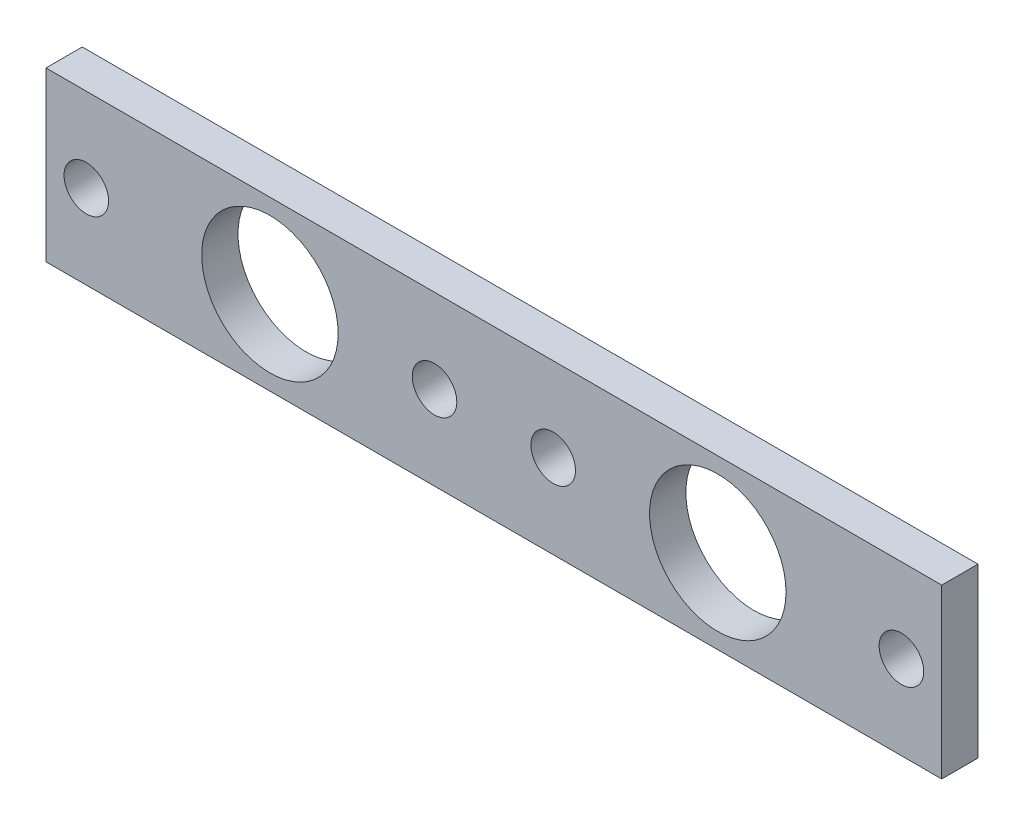
ISO-10303-21;
HEADER;
FILE_DESCRIPTION(('STEP AP214'),'2;1');
FILE_NAME('part.step','',(''),(''),'','','');
FILE_SCHEMA(('AUTOMOTIVE_DESIGN { 1 0 10303 214 1 1 1 1 }'));
ENDSEC;
DATA;
#1=APPLICATION_CONTEXT('core data for automotive mechanical design processes');
#2=APPLICATION_PROTOCOL_DEFINITION('international standard','automotive_design',2000,#1);
#3=PRODUCT_CONTEXT('',#1,'mechanical');
#4=PRODUCT('Part','Part','',(#3));
#5=PRODUCT_RELATED_PRODUCT_CATEGORY('part','',(#4));
#6=PRODUCT_DEFINITION_FORMATION('','',#4);
#7=PRODUCT_DEFINITION_CONTEXT('part definition',#1,'design');
#8=PRODUCT_DEFINITION('design','',#6,#7);
#9=PRODUCT_DEFINITION_SHAPE('','',#8);
#10=(LENGTH_UNIT() NAMED_UNIT(*) SI_UNIT(.MILLI.,.METRE.));
#11=(NAMED_UNIT(*) PLANE_ANGLE_UNIT() SI_UNIT($,.RADIAN.));
#12=(NAMED_UNIT(*) SI_UNIT($,.STERADIAN.) SOLID_ANGLE_UNIT());
#13=UNCERTAINTY_MEASURE_WITH_UNIT(LENGTH_MEASURE(1.E-05),#10,'distance_accuracy_value','');
#14=(GEOMETRIC_REPRESENTATION_CONTEXT(3) GLOBAL_UNCERTAINTY_ASSIGNED_CONTEXT((#13)) GLOBAL_UNIT_ASSIGNED_CONTEXT((#10,
#11,#12)) REPRESENTATION_CONTEXT('',''));
#15=CARTESIAN_POINT('',(0.,0.,0.));
#16=DIRECTION('',(0.,0.,1.));
#17=DIRECTION('',(1.,0.,0.));
#18=AXIS2_PLACEMENT_3D('',#15,#16,#17);
#19=CARTESIAN_POINT('',(-50.8,9.525,4.1148));
#20=DIRECTION('',(1.,0.,0.));
#21=DIRECTION('',(0.,0.,-1.));
#22=AXIS2_PLACEMENT_3D('',#19,#20,#21);
#23=PLANE('',#22);
#24=DIRECTION('',(0.,-1.,0.));
#25=VECTOR('',#24,1.);
#26=CARTESIAN_POINT('',(-50.8,9.525,0.));
#27=LINE('',#26,#25);
#28=CARTESIAN_POINT('',(-50.8,9.525,0.));
#29=VERTEX_POINT('',#28);
#30=CARTESIAN_POINT('',(-50.8,-9.525,0.));
#31=VERTEX_POINT('',#30);
#32=EDGE_CURVE('E108',#29,#31,#27,.T.);
#33=ORIENTED_EDGE('',*,*,#32,.T.);
#34=DIRECTION('',(0.,0.,-1.));
#35=VECTOR('',#34,1.);
#36=CARTESIAN_POINT('',(-50.8,-9.525,4.1148));
#37=LINE('',#36,#35);
#38=CARTESIAN_POINT('',(-50.8,-9.525,4.1148));
#39=VERTEX_POINT('',#38);
#40=EDGE_CURVE('E13',#39,#31,#37,.T.);
#41=ORIENTED_EDGE('',*,*,#40,.F.);
#42=DIRECTION('',(0.,-1.,0.));
#43=VECTOR('',#42,1.);
#44=CARTESIAN_POINT('',(-50.8,9.525,4.1148));
#45=LINE('',#44,#43);
#46=CARTESIAN_POINT('',(-50.8,9.525,4.1148));
#47=VERTEX_POINT('',#46);
#48=EDGE_CURVE('E96',#47,#39,#45,.T.);
#49=ORIENTED_EDGE('',*,*,#48,.F.);
#50=DIRECTION('',(0.,0.,-1.));
#51=VECTOR('',#50,1.);
#52=CARTESIAN_POINT('',(-50.8,9.525,4.1148));
#53=LINE('',#52,#51);
#54=EDGE_CURVE('E104',#47,#29,#53,.T.);
#55=ORIENTED_EDGE('',*,*,#54,.T.);
#56=EDGE_LOOP('',(#33,#41,#49,#55));
#57=FACE_BOUND('',#56,.T.);
#58=ADVANCED_FACE('F45',(#57),#23,.F.);
#59=CARTESIAN_POINT('',(-50.8,-9.525,4.1148));
#60=DIRECTION('',(0.,1.,0.));
#61=DIRECTION('',(-1.,0.,0.));
#62=AXIS2_PLACEMENT_3D('',#59,#60,#61);
#63=PLANE('',#62);
#64=DIRECTION('',(1.,0.,0.));
#65=VECTOR('',#64,1.);
#66=CARTESIAN_POINT('',(-50.8,-9.525,0.));
#67=LINE('',#66,#65);
#68=CARTESIAN_POINT('',(50.8,-9.52499999999998,0.));
#69=VERTEX_POINT('',#68);
#70=EDGE_CURVE('E100',#31,#69,#67,.T.);
#71=ORIENTED_EDGE('',*,*,#70,.T.);
#72=DIRECTION('',(0.,0.,-1.));
#73=VECTOR('',#72,1.);
#74=CARTESIAN_POINT('',(50.8,-9.52499999999998,4.1148));
#75=LINE('',#74,#73);
#76=CARTESIAN_POINT('',(50.8,-9.52499999999998,4.1148));
#77=VERTEX_POINT('',#76);
#78=EDGE_CURVE('E53',#77,#69,#75,.T.);
#79=ORIENTED_EDGE('',*,*,#78,.F.);
#80=DIRECTION('',(1.,0.,0.));
#81=VECTOR('',#80,1.);
#82=CARTESIAN_POINT('',(-50.8,-9.525,4.1148));
#83=LINE('',#82,#81);
#84=EDGE_CURVE('E91',#39,#77,#83,.T.);
#85=ORIENTED_EDGE('',*,*,#84,.F.);
#86=ORIENTED_EDGE('',*,*,#40,.T.);
#87=EDGE_LOOP('',(#71,#79,#85,#86));
#88=FACE_BOUND('',#87,.T.);
#89=ADVANCED_FACE('F99',(#88),#63,.F.);
#90=CARTESIAN_POINT('',(50.8,9.52499999999999,4.1148));
#91=DIRECTION('',(-1.,0.,0.));
#92=DIRECTION('',(0.,0.,1.));
#93=AXIS2_PLACEMENT_3D('',#90,#91,#92);
#94=PLANE('',#93);
#95=DIRECTION('',(0.,1.,0.));
#96=VECTOR('',#95,1.);
#97=CARTESIAN_POINT('',(50.8,9.52499999999999,0.));
#98=LINE('',#97,#96);
#99=CARTESIAN_POINT('',(50.8,9.52499999999999,0.));
#100=VERTEX_POINT('',#99);
#101=EDGE_CURVE('E78',#69,#100,#98,.T.);
#102=ORIENTED_EDGE('',*,*,#101,.T.);
#103=DIRECTION('',(0.,0.,-1.));
#104=VECTOR('',#103,1.);
#105=CARTESIAN_POINT('',(50.8,9.52499999999999,4.1148));
#106=LINE('',#105,#104);
#107=CARTESIAN_POINT('',(50.8,9.52499999999999,4.1148));
#108=VERTEX_POINT('',#107);
#109=EDGE_CURVE('E101',#108,#100,#106,.T.);
#110=ORIENTED_EDGE('',*,*,#109,.F.);
#111=DIRECTION('',(0.,1.,0.));
#112=VECTOR('',#111,1.);
#113=CARTESIAN_POINT('',(50.8,9.52499999999999,4.1148));
#114=LINE('',#113,#112);
#115=EDGE_CURVE('E94',#77,#108,#114,.T.);
#116=ORIENTED_EDGE('',*,*,#115,.F.);
#117=ORIENTED_EDGE('',*,*,#78,.T.);
#118=EDGE_LOOP('',(#102,#110,#116,#117));
#119=FACE_BOUND('',#118,.T.);
#120=ADVANCED_FACE('F102',(#119),#94,.F.);
#121=CARTESIAN_POINT('',(-50.8,9.525,4.1148));
#122=DIRECTION('',(0.,-1.,0.));
#123=DIRECTION('',(1.,0.,0.));
#124=AXIS2_PLACEMENT_3D('',#121,#122,#123);
#125=PLANE('',#124);
#126=DIRECTION('',(-1.,0.,0.));
#127=VECTOR('',#126,1.);
#128=CARTESIAN_POINT('',(-50.8,9.525,0.));
#129=LINE('',#128,#127);
#130=EDGE_CURVE('E84',#100,#29,#129,.T.);
#131=ORIENTED_EDGE('',*,*,#130,.T.);
#132=ORIENTED_EDGE('',*,*,#54,.F.);
#133=DIRECTION('',(-1.,0.,0.));
#134=VECTOR('',#133,1.);
#135=CARTESIAN_POINT('',(-50.8,9.525,4.1148));
#136=LINE('',#135,#134);
#137=EDGE_CURVE('E61',#108,#47,#136,.T.);
#138=ORIENTED_EDGE('',*,*,#137,.F.);
#139=ORIENTED_EDGE('',*,*,#109,.T.);
#140=EDGE_LOOP('',(#131,#132,#138,#139));
#141=FACE_BOUND('',#140,.T.);
#142=ADVANCED_FACE('F116',(#141),#125,.F.);
#143=CARTESIAN_POINT('',(-50.8,-9.525,4.1148));
#144=DIRECTION('',(0.,0.,1.));
#145=DIRECTION('',(1.,0.,0.));
#146=AXIS2_PLACEMENT_3D('',#143,#144,#145);
#147=PLANE('',#146);
#148=CARTESIAN_POINT('',(-25.4,0.,4.1148));
#149=DIRECTION('',(0.,0.,1.));
#150=DIRECTION('',(1.,0.,0.));
#151=AXIS2_PLACEMENT_3D('',#148,#149,#150);
#152=CIRCLE('',#151,7.739126);
#153=CARTESIAN_POINT('',(-17.660874,0.,4.1148));
#154=VERTEX_POINT('',#153);
#155=EDGE_CURVE('E154',#154,#154,#152,.T.);
#156=ORIENTED_EDGE('',*,*,#155,.F.);
#157=EDGE_LOOP('',(#156));
#158=FACE_BOUND('',#157,.T.);
#159=CARTESIAN_POINT('',(25.4,0.,4.1148));
#160=DIRECTION('',(0.,0.,1.));
#161=DIRECTION('',(1.,0.,0.));
#162=AXIS2_PLACEMENT_3D('',#159,#160,#161);
#163=CIRCLE('',#162,7.739126);
#164=CARTESIAN_POINT('',(33.139126,0.,4.1148));
#165=VERTEX_POINT('',#164);
#166=EDGE_CURVE('E148',#165,#165,#163,.T.);
#167=ORIENTED_EDGE('',*,*,#166,.F.);
#168=EDGE_LOOP('',(#167));
#169=FACE_BOUND('',#168,.T.);
#170=CARTESIAN_POINT('',(-46.228,0.,4.1148));
#171=DIRECTION('',(0.,0.,1.));
#172=DIRECTION('',(1.,0.,0.));
#173=AXIS2_PLACEMENT_3D('',#170,#171,#172);
#174=CIRCLE('',#173,2.5273);
#175=CARTESIAN_POINT('',(-43.7007,0.,4.1148));
#176=VERTEX_POINT('',#175);
#177=EDGE_CURVE('E142',#176,#176,#174,.T.);
#178=ORIENTED_EDGE('',*,*,#177,.F.);
#179=EDGE_LOOP('',(#178));
#180=FACE_BOUND('',#179,.T.);
#181=CARTESIAN_POINT('',(-6.73099999999999,0.,4.1148));
#182=DIRECTION('',(0.,0.,1.));
#183=DIRECTION('',(1.,0.,0.));
#184=AXIS2_PLACEMENT_3D('',#181,#182,#183);
#185=CIRCLE('',#184,2.5273);
#186=CARTESIAN_POINT('',(-4.20369999999999,0.,4.1148));
#187=VERTEX_POINT('',#186);
#188=EDGE_CURVE('E136',#187,#187,#185,.T.);
#189=ORIENTED_EDGE('',*,*,#188,.F.);
#190=EDGE_LOOP('',(#189));
#191=FACE_BOUND('',#190,.T.);
#192=CARTESIAN_POINT('',(6.731,0.,4.1148));
#193=DIRECTION('',(0.,0.,1.));
#194=DIRECTION('',(1.,0.,0.));
#195=AXIS2_PLACEMENT_3D('',#192,#193,#194);
#196=CIRCLE('',#195,2.5273);
#197=CARTESIAN_POINT('',(9.2583,0.,4.1148));
#198=VERTEX_POINT('',#197);
#199=EDGE_CURVE('E130',#198,#198,#196,.T.);
#200=ORIENTED_EDGE('',*,*,#199,.F.);
#201=EDGE_LOOP('',(#200));
#202=FACE_BOUND('',#201,.T.);
#203=CARTESIAN_POINT('',(46.228,0.,4.1148));
#204=DIRECTION('',(0.,0.,1.));
#205=DIRECTION('',(1.,0.,0.));
#206=AXIS2_PLACEMENT_3D('',#203,#204,#205);
#207=CIRCLE('',#206,2.5273);
#208=CARTESIAN_POINT('',(48.7553,0.,4.1148));
#209=VERTEX_POINT('',#208);
#210=EDGE_CURVE('E124',#209,#209,#207,.T.);
#211=ORIENTED_EDGE('',*,*,#210,.F.);
#212=EDGE_LOOP('',(#211));
#213=FACE_BOUND('',#212,.T.);
#214=ORIENTED_EDGE('',*,*,#48,.T.);
#215=ORIENTED_EDGE('',*,*,#84,.T.);
#216=ORIENTED_EDGE('',*,*,#115,.T.);
#217=ORIENTED_EDGE('',*,*,#137,.T.);
#218=EDGE_LOOP('',(#214,#215,#216,#217));
#219=FACE_BOUND('',#218,.T.);
#220=ADVANCED_FACE('F92',(#158,#169,#180,#191,#202,#213,#219),#147,.T.);
#221=CARTESIAN_POINT('',(-50.8,-9.525,0.));
#222=DIRECTION('',(0.,0.,1.));
#223=DIRECTION('',(1.,0.,0.));
#224=AXIS2_PLACEMENT_3D('',#221,#222,#223);
#225=PLANE('',#224);
#226=CARTESIAN_POINT('',(-25.4,0.,0.));
#227=DIRECTION('',(0.,0.,1.));
#228=DIRECTION('',(1.,0.,0.));
#229=AXIS2_PLACEMENT_3D('',#226,#227,#228);
#230=CIRCLE('',#229,7.739126);
#231=CARTESIAN_POINT('',(-17.660874,0.,0.));
#232=VERTEX_POINT('',#231);
#233=EDGE_CURVE('E151',#232,#232,#230,.T.);
#234=ORIENTED_EDGE('',*,*,#233,.T.);
#235=EDGE_LOOP('',(#234));
#236=FACE_BOUND('',#235,.T.);
#237=CARTESIAN_POINT('',(25.4,0.,0.));
#238=DIRECTION('',(0.,0.,1.));
#239=DIRECTION('',(1.,0.,0.));
#240=AXIS2_PLACEMENT_3D('',#237,#238,#239);
#241=CIRCLE('',#240,7.739126);
#242=CARTESIAN_POINT('',(33.139126,0.,0.));
#243=VERTEX_POINT('',#242);
#244=EDGE_CURVE('E145',#243,#243,#241,.T.);
#245=ORIENTED_EDGE('',*,*,#244,.T.);
#246=EDGE_LOOP('',(#245));
#247=FACE_BOUND('',#246,.T.);
#248=CARTESIAN_POINT('',(-46.228,0.,0.));
#249=DIRECTION('',(0.,0.,1.));
#250=DIRECTION('',(1.,0.,0.));
#251=AXIS2_PLACEMENT_3D('',#248,#249,#250);
#252=CIRCLE('',#251,2.5273);
#253=CARTESIAN_POINT('',(-43.7007,0.,0.));
#254=VERTEX_POINT('',#253);
#255=EDGE_CURVE('E139',#254,#254,#252,.T.);
#256=ORIENTED_EDGE('',*,*,#255,.T.);
#257=EDGE_LOOP('',(#256));
#258=FACE_BOUND('',#257,.T.);
#259=CARTESIAN_POINT('',(-6.73099999999999,0.,0.));
#260=DIRECTION('',(0.,0.,1.));
#261=DIRECTION('',(1.,0.,0.));
#262=AXIS2_PLACEMENT_3D('',#259,#260,#261);
#263=CIRCLE('',#262,2.5273);
#264=CARTESIAN_POINT('',(-4.20369999999999,0.,0.));
#265=VERTEX_POINT('',#264);
#266=EDGE_CURVE('E133',#265,#265,#263,.T.);
#267=ORIENTED_EDGE('',*,*,#266,.T.);
#268=EDGE_LOOP('',(#267));
#269=FACE_BOUND('',#268,.T.);
#270=CARTESIAN_POINT('',(6.731,0.,0.));
#271=DIRECTION('',(0.,0.,1.));
#272=DIRECTION('',(1.,0.,0.));
#273=AXIS2_PLACEMENT_3D('',#270,#271,#272);
#274=CIRCLE('',#273,2.5273);
#275=CARTESIAN_POINT('',(9.2583,0.,0.));
#276=VERTEX_POINT('',#275);
#277=EDGE_CURVE('E127',#276,#276,#274,.T.);
#278=ORIENTED_EDGE('',*,*,#277,.T.);
#279=EDGE_LOOP('',(#278));
#280=FACE_BOUND('',#279,.T.);
#281=CARTESIAN_POINT('',(46.228,0.,0.));
#282=DIRECTION('',(0.,0.,1.));
#283=DIRECTION('',(1.,0.,0.));
#284=AXIS2_PLACEMENT_3D('',#281,#282,#283);
#285=CIRCLE('',#284,2.5273);
#286=CARTESIAN_POINT('',(48.7553,0.,0.));
#287=VERTEX_POINT('',#286);
#288=EDGE_CURVE('E111',#287,#287,#285,.T.);
#289=ORIENTED_EDGE('',*,*,#288,.T.);
#290=EDGE_LOOP('',(#289));
#291=FACE_BOUND('',#290,.T.);
#292=ORIENTED_EDGE('',*,*,#32,.F.);
#293=ORIENTED_EDGE('',*,*,#130,.F.);
#294=ORIENTED_EDGE('',*,*,#101,.F.);
#295=ORIENTED_EDGE('',*,*,#70,.F.);
#296=EDGE_LOOP('',(#292,#293,#294,#295));
#297=FACE_BOUND('',#296,.T.);
#298=ADVANCED_FACE('F119',(#236,#247,#258,#269,#280,#291,#297),#225,.F.);
#299=CARTESIAN_POINT('',(46.228,0.,4.1148));
#300=DIRECTION('',(0.,0.,1.));
#301=DIRECTION('',(1.,0.,0.));
#302=AXIS2_PLACEMENT_3D('',#299,#300,#301);
#303=CYLINDRICAL_SURFACE('',#302,2.5273);
#304=ORIENTED_EDGE('',*,*,#288,.F.);
#305=EDGE_LOOP('',(#304));
#306=FACE_BOUND('',#305,.T.);
#307=ORIENTED_EDGE('',*,*,#210,.T.);
#308=EDGE_LOOP('',(#307));
#309=FACE_BOUND('',#308,.T.);
#310=ADVANCED_FACE('F173',(#306,#309),#303,.F.);
#311=CARTESIAN_POINT('',(6.731,0.,4.1148));
#312=DIRECTION('',(0.,0.,1.));
#313=DIRECTION('',(1.,0.,0.));
#314=AXIS2_PLACEMENT_3D('',#311,#312,#313);
#315=CYLINDRICAL_SURFACE('',#314,2.5273);
#316=ORIENTED_EDGE('',*,*,#277,.F.);
#317=EDGE_LOOP('',(#316));
#318=FACE_BOUND('',#317,.T.);
#319=ORIENTED_EDGE('',*,*,#199,.T.);
#320=EDGE_LOOP('',(#319));
#321=FACE_BOUND('',#320,.T.);
#322=ADVANCED_FACE('F175',(#318,#321),#315,.F.);
#323=CARTESIAN_POINT('',(-6.73099999999999,0.,4.1148));
#324=DIRECTION('',(0.,0.,1.));
#325=DIRECTION('',(1.,0.,0.));
#326=AXIS2_PLACEMENT_3D('',#323,#324,#325);
#327=CYLINDRICAL_SURFACE('',#326,2.5273);
#328=ORIENTED_EDGE('',*,*,#266,.F.);
#329=EDGE_LOOP('',(#328));
#330=FACE_BOUND('',#329,.T.);
#331=ORIENTED_EDGE('',*,*,#188,.T.);
#332=EDGE_LOOP('',(#331));
#333=FACE_BOUND('',#332,.T.);
#334=ADVANCED_FACE('F182',(#330,#333),#327,.F.);
#335=CARTESIAN_POINT('',(-46.228,0.,4.1148));
#336=DIRECTION('',(0.,0.,1.));
#337=DIRECTION('',(1.,0.,0.));
#338=AXIS2_PLACEMENT_3D('',#335,#336,#337);
#339=CYLINDRICAL_SURFACE('',#338,2.5273);
#340=ORIENTED_EDGE('',*,*,#255,.F.);
#341=EDGE_LOOP('',(#340));
#342=FACE_BOUND('',#341,.T.);
#343=ORIENTED_EDGE('',*,*,#177,.T.);
#344=EDGE_LOOP('',(#343));
#345=FACE_BOUND('',#344,.T.);
#346=ADVANCED_FACE('F222',(#342,#345),#339,.F.);
#347=CARTESIAN_POINT('',(25.4,0.,4.1148));
#348=DIRECTION('',(0.,0.,1.));
#349=DIRECTION('',(1.,0.,0.));
#350=AXIS2_PLACEMENT_3D('',#347,#348,#349);
#351=CYLINDRICAL_SURFACE('',#350,7.739126);
#352=ORIENTED_EDGE('',*,*,#244,.F.);
#353=EDGE_LOOP('',(#352));
#354=FACE_BOUND('',#353,.T.);
#355=ORIENTED_EDGE('',*,*,#166,.T.);
#356=EDGE_LOOP('',(#355));
#357=FACE_BOUND('',#356,.T.);
#358=ADVANCED_FACE('F217',(#354,#357),#351,.F.);
#359=CARTESIAN_POINT('',(-25.4,0.,4.1148));
#360=DIRECTION('',(0.,0.,1.));
#361=DIRECTION('',(1.,0.,0.));
#362=AXIS2_PLACEMENT_3D('',#359,#360,#361);
#363=CYLINDRICAL_SURFACE('',#362,7.739126);
#364=ORIENTED_EDGE('',*,*,#233,.F.);
#365=EDGE_LOOP('',(#364));
#366=FACE_BOUND('',#365,.T.);
#367=ORIENTED_EDGE('',*,*,#155,.T.);
#368=EDGE_LOOP('',(#367));
#369=FACE_BOUND('',#368,.T.);
#370=ADVANCED_FACE('F158',(#366,#369),#363,.F.);
#371=CLOSED_SHELL('',(#58,#89,#120,#142,#220,#298,#310,#322,#334,#346,#358,#370));
#372=MANIFOLD_SOLID_BREP('B2',#371);
#373=ADVANCED_BREP_SHAPE_REPRESENTATION('',(#18,#372),#14);
#374=SHAPE_DEFINITION_REPRESENTATION(#9,#373);
ENDSEC;
END-ISO-10303-21;
